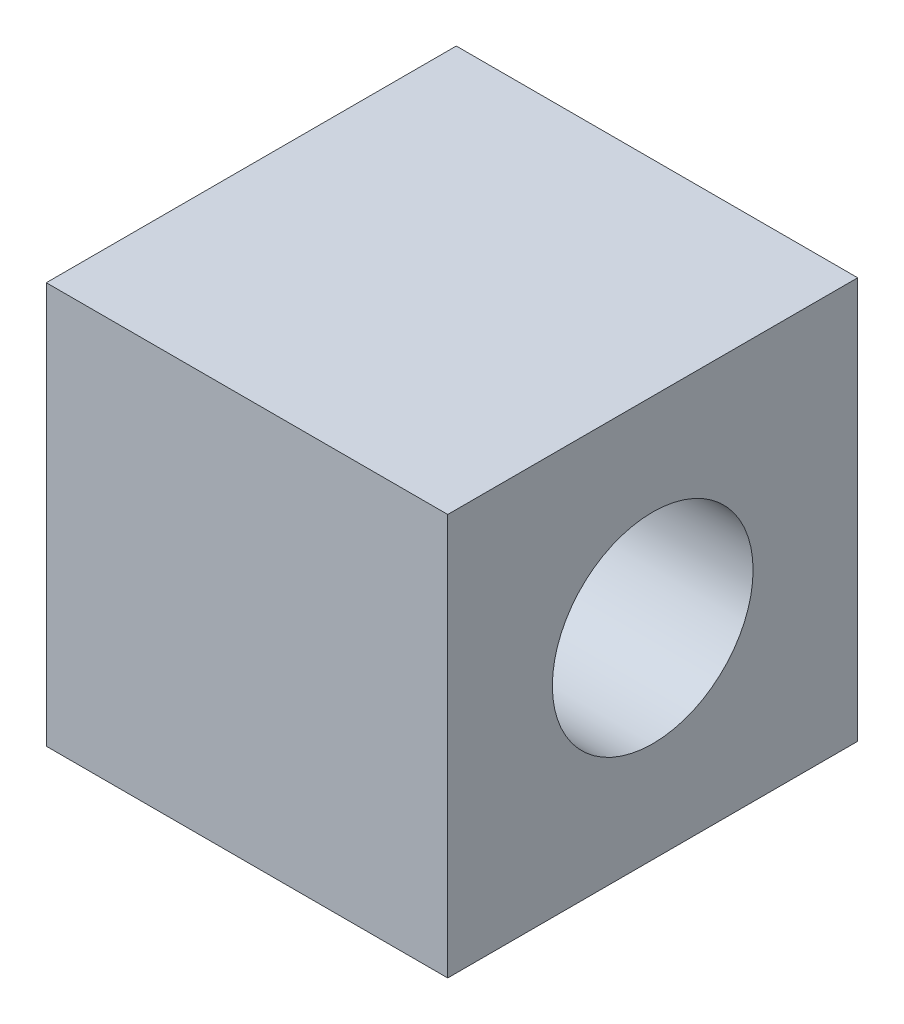
ISO-10303-21;
HEADER;
FILE_DESCRIPTION(('STEP AP214'),'2;1');
FILE_NAME('part.step','',(''),(''),'','','');
FILE_SCHEMA(('AUTOMOTIVE_DESIGN { 1 0 10303 214 1 1 1 1 }'));
ENDSEC;
DATA;
#1=APPLICATION_CONTEXT('core data for automotive mechanical design processes');
#2=APPLICATION_PROTOCOL_DEFINITION('international standard','automotive_design',2000,#1);
#3=PRODUCT_CONTEXT('',#1,'mechanical');
#4=PRODUCT('Part','Part','',(#3));
#5=PRODUCT_RELATED_PRODUCT_CATEGORY('part','',(#4));
#6=PRODUCT_DEFINITION_FORMATION('','',#4);
#7=PRODUCT_DEFINITION_CONTEXT('part definition',#1,'design');
#8=PRODUCT_DEFINITION('design','',#6,#7);
#9=PRODUCT_DEFINITION_SHAPE('','',#8);
#10=(LENGTH_UNIT() NAMED_UNIT(*) SI_UNIT(.MILLI.,.METRE.));
#11=(NAMED_UNIT(*) PLANE_ANGLE_UNIT() SI_UNIT($,.RADIAN.));
#12=(NAMED_UNIT(*) SI_UNIT($,.STERADIAN.) SOLID_ANGLE_UNIT());
#13=UNCERTAINTY_MEASURE_WITH_UNIT(LENGTH_MEASURE(1.E-05),#10,'distance_accuracy_value','');
#14=(GEOMETRIC_REPRESENTATION_CONTEXT(3) GLOBAL_UNCERTAINTY_ASSIGNED_CONTEXT((#13)) GLOBAL_UNIT_ASSIGNED_CONTEXT((#10,
#11,#12)) REPRESENTATION_CONTEXT('',''));
#15=CARTESIAN_POINT('',(0.,0.,0.));
#16=DIRECTION('',(0.,0.,1.));
#17=DIRECTION('',(1.,0.,0.));
#18=AXIS2_PLACEMENT_3D('',#15,#16,#17);
#19=CARTESIAN_POINT('',(10.,0.,0.));
#20=DIRECTION('',(-1.,0.,0.));
#21=DIRECTION('',(0.,0.,1.));
#22=AXIS2_PLACEMENT_3D('',#19,#20,#21);
#23=PLANE('',#22);
#24=DIRECTION('',(0.,1.,0.));
#25=VECTOR('',#24,1.);
#26=CARTESIAN_POINT('',(10.,-5.,-5.10646211564857));
#27=LINE('',#26,#25);
#28=CARTESIAN_POINT('',(10.,-5.,-5.10646211564857));
#29=VERTEX_POINT('',#28);
#30=CARTESIAN_POINT('',(10.,5.,-5.10646211564857));
#31=VERTEX_POINT('',#30);
#32=EDGE_CURVE('E86',#29,#31,#27,.T.);
#33=ORIENTED_EDGE('',*,*,#32,.T.);
#34=DIRECTION('',(0.,0.,1.));
#35=VECTOR('',#34,1.);
#36=CARTESIAN_POINT('',(10.,5.,5.10646211564857));
#37=LINE('',#36,#35);
#38=CARTESIAN_POINT('',(10.,5.,5.10646211564857));
#39=VERTEX_POINT('',#38);
#40=EDGE_CURVE('E81',#31,#39,#37,.T.);
#41=ORIENTED_EDGE('',*,*,#40,.T.);
#42=DIRECTION('',(0.,-1.,0.));
#43=VECTOR('',#42,1.);
#44=CARTESIAN_POINT('',(10.,-5.,5.10646211564857));
#45=LINE('',#44,#43);
#46=CARTESIAN_POINT('',(10.,-5.,5.10646211564857));
#47=VERTEX_POINT('',#46);
#48=EDGE_CURVE('E84',#39,#47,#45,.T.);
#49=ORIENTED_EDGE('',*,*,#48,.T.);
#50=DIRECTION('',(0.,0.,-1.));
#51=VECTOR('',#50,1.);
#52=CARTESIAN_POINT('',(10.,-5.,5.10646211564857));
#53=LINE('',#52,#51);
#54=EDGE_CURVE('E51',#47,#29,#53,.T.);
#55=ORIENTED_EDGE('',*,*,#54,.T.);
#56=EDGE_LOOP('',(#33,#41,#49,#55));
#57=FACE_BOUND('',#56,.T.);
#58=CARTESIAN_POINT('',(10.,0.,0.));
#59=DIRECTION('',(1.,0.,0.));
#60=DIRECTION('',(0.,0.,-1.));
#61=AXIS2_PLACEMENT_3D('',#58,#59,#60);
#62=CIRCLE('',#61,2.5);
#63=CARTESIAN_POINT('',(10.,0.,-2.5));
#64=VERTEX_POINT('',#63);
#65=EDGE_CURVE('E101',#64,#64,#62,.T.);
#66=ORIENTED_EDGE('',*,*,#65,.F.);
#67=EDGE_LOOP('',(#66));
#68=FACE_BOUND('',#67,.T.);
#69=ADVANCED_FACE('F34',(#57,#68),#23,.F.);
#70=CARTESIAN_POINT('',(0.,0.,0.));
#71=DIRECTION('',(-1.,0.,0.));
#72=DIRECTION('',(0.,0.,1.));
#73=AXIS2_PLACEMENT_3D('',#70,#71,#72);
#74=PLANE('',#73);
#75=DIRECTION('',(0.,1.,0.));
#76=VECTOR('',#75,1.);
#77=CARTESIAN_POINT('',(0.,-5.,-5.10646211564857));
#78=LINE('',#77,#76);
#79=CARTESIAN_POINT('',(0.,-5.,-5.10646211564857));
#80=VERTEX_POINT('',#79);
#81=CARTESIAN_POINT('',(0.,5.,-5.10646211564857));
#82=VERTEX_POINT('',#81);
#83=EDGE_CURVE('E98',#80,#82,#78,.T.);
#84=ORIENTED_EDGE('',*,*,#83,.F.);
#85=DIRECTION('',(0.,0.,-1.));
#86=VECTOR('',#85,1.);
#87=CARTESIAN_POINT('',(0.,-5.,5.10646211564857));
#88=LINE('',#87,#86);
#89=CARTESIAN_POINT('',(0.,-5.,5.10646211564857));
#90=VERTEX_POINT('',#89);
#91=EDGE_CURVE('E74',#90,#80,#88,.T.);
#92=ORIENTED_EDGE('',*,*,#91,.F.);
#93=DIRECTION('',(0.,-1.,0.));
#94=VECTOR('',#93,1.);
#95=CARTESIAN_POINT('',(0.,-5.,5.10646211564857));
#96=LINE('',#95,#94);
#97=CARTESIAN_POINT('',(0.,5.,5.10646211564857));
#98=VERTEX_POINT('',#97);
#99=EDGE_CURVE('E68',#98,#90,#96,.T.);
#100=ORIENTED_EDGE('',*,*,#99,.F.);
#101=DIRECTION('',(0.,0.,1.));
#102=VECTOR('',#101,1.);
#103=CARTESIAN_POINT('',(0.,5.,5.10646211564857));
#104=LINE('',#103,#102);
#105=EDGE_CURVE('E90',#82,#98,#104,.T.);
#106=ORIENTED_EDGE('',*,*,#105,.F.);
#107=EDGE_LOOP('',(#84,#92,#100,#106));
#108=FACE_BOUND('',#107,.T.);
#109=CARTESIAN_POINT('',(0.,0.,0.));
#110=DIRECTION('',(1.,0.,0.));
#111=DIRECTION('',(0.,0.,-1.));
#112=AXIS2_PLACEMENT_3D('',#109,#110,#111);
#113=CIRCLE('',#112,2.5);
#114=CARTESIAN_POINT('',(0.,0.,-2.5));
#115=VERTEX_POINT('',#114);
#116=EDGE_CURVE('E113',#115,#115,#113,.T.);
#117=ORIENTED_EDGE('',*,*,#116,.T.);
#118=EDGE_LOOP('',(#117));
#119=FACE_BOUND('',#118,.T.);
#120=ADVANCED_FACE('F109',(#108,#119),#74,.T.);
#121=CARTESIAN_POINT('',(10.,-5.,-5.10646211564857));
#122=DIRECTION('',(0.,0.,1.));
#123=DIRECTION('',(1.,0.,0.));
#124=AXIS2_PLACEMENT_3D('',#121,#122,#123);
#125=PLANE('',#124);
#126=ORIENTED_EDGE('',*,*,#83,.T.);
#127=DIRECTION('',(-1.,0.,0.));
#128=VECTOR('',#127,1.);
#129=CARTESIAN_POINT('',(10.,5.,-5.10646211564857));
#130=LINE('',#129,#128);
#131=EDGE_CURVE('E11',#31,#82,#130,.T.);
#132=ORIENTED_EDGE('',*,*,#131,.F.);
#133=ORIENTED_EDGE('',*,*,#32,.F.);
#134=DIRECTION('',(-1.,0.,0.));
#135=VECTOR('',#134,1.);
#136=CARTESIAN_POINT('',(10.,-5.,-5.10646211564857));
#137=LINE('',#136,#135);
#138=EDGE_CURVE('E94',#29,#80,#137,.T.);
#139=ORIENTED_EDGE('',*,*,#138,.T.);
#140=EDGE_LOOP('',(#126,#132,#133,#139));
#141=FACE_BOUND('',#140,.T.);
#142=ADVANCED_FACE('F36',(#141),#125,.F.);
#143=CARTESIAN_POINT('',(10.,5.,5.10646211564857));
#144=DIRECTION('',(0.,-1.,0.));
#145=DIRECTION('',(0.,0.,-1.));
#146=AXIS2_PLACEMENT_3D('',#143,#144,#145);
#147=PLANE('',#146);
#148=ORIENTED_EDGE('',*,*,#105,.T.);
#149=DIRECTION('',(-1.,0.,0.));
#150=VECTOR('',#149,1.);
#151=CARTESIAN_POINT('',(10.,5.,5.10646211564857));
#152=LINE('',#151,#150);
#153=EDGE_CURVE('E43',#39,#98,#152,.T.);
#154=ORIENTED_EDGE('',*,*,#153,.F.);
#155=ORIENTED_EDGE('',*,*,#40,.F.);
#156=ORIENTED_EDGE('',*,*,#131,.T.);
#157=EDGE_LOOP('',(#148,#154,#155,#156));
#158=FACE_BOUND('',#157,.T.);
#159=ADVANCED_FACE('F89',(#158),#147,.F.);
#160=CARTESIAN_POINT('',(10.,-5.,5.10646211564857));
#161=DIRECTION('',(0.,0.,-1.));
#162=DIRECTION('',(-1.,0.,0.));
#163=AXIS2_PLACEMENT_3D('',#160,#161,#162);
#164=PLANE('',#163);
#165=ORIENTED_EDGE('',*,*,#99,.T.);
#166=DIRECTION('',(-1.,0.,0.));
#167=VECTOR('',#166,1.);
#168=CARTESIAN_POINT('',(10.,-5.,5.10646211564857));
#169=LINE('',#168,#167);
#170=EDGE_CURVE('E91',#47,#90,#169,.T.);
#171=ORIENTED_EDGE('',*,*,#170,.F.);
#172=ORIENTED_EDGE('',*,*,#48,.F.);
#173=ORIENTED_EDGE('',*,*,#153,.T.);
#174=EDGE_LOOP('',(#165,#171,#172,#173));
#175=FACE_BOUND('',#174,.T.);
#176=ADVANCED_FACE('F92',(#175),#164,.F.);
#177=CARTESIAN_POINT('',(10.,-5.,5.10646211564857));
#178=DIRECTION('',(0.,1.,0.));
#179=DIRECTION('',(0.,0.,1.));
#180=AXIS2_PLACEMENT_3D('',#177,#178,#179);
#181=PLANE('',#180);
#182=ORIENTED_EDGE('',*,*,#91,.T.);
#183=ORIENTED_EDGE('',*,*,#138,.F.);
#184=ORIENTED_EDGE('',*,*,#54,.F.);
#185=ORIENTED_EDGE('',*,*,#170,.T.);
#186=EDGE_LOOP('',(#182,#183,#184,#185));
#187=FACE_BOUND('',#186,.T.);
#188=ADVANCED_FACE('F106',(#187),#181,.F.);
#189=CARTESIAN_POINT('',(10.,0.,0.));
#190=DIRECTION('',(-1.,0.,0.));
#191=DIRECTION('',(0.,0.,1.));
#192=AXIS2_PLACEMENT_3D('',#189,#190,#191);
#193=CYLINDRICAL_SURFACE('',#192,2.5);
#194=ORIENTED_EDGE('',*,*,#65,.T.);
#195=EDGE_LOOP('',(#194));
#196=FACE_BOUND('',#195,.T.);
#197=ORIENTED_EDGE('',*,*,#116,.F.);
#198=EDGE_LOOP('',(#197));
#199=FACE_BOUND('',#198,.T.);
#200=ADVANCED_FACE('F119',(#196,#199),#193,.F.);
#201=CLOSED_SHELL('',(#69,#120,#142,#159,#176,#188,#200));
#202=MANIFOLD_SOLID_BREP('B2',#201);
#203=ADVANCED_BREP_SHAPE_REPRESENTATION('',(#18,#202),#14);
#204=SHAPE_DEFINITION_REPRESENTATION(#9,#203);
ENDSEC;
END-ISO-10303-21;
